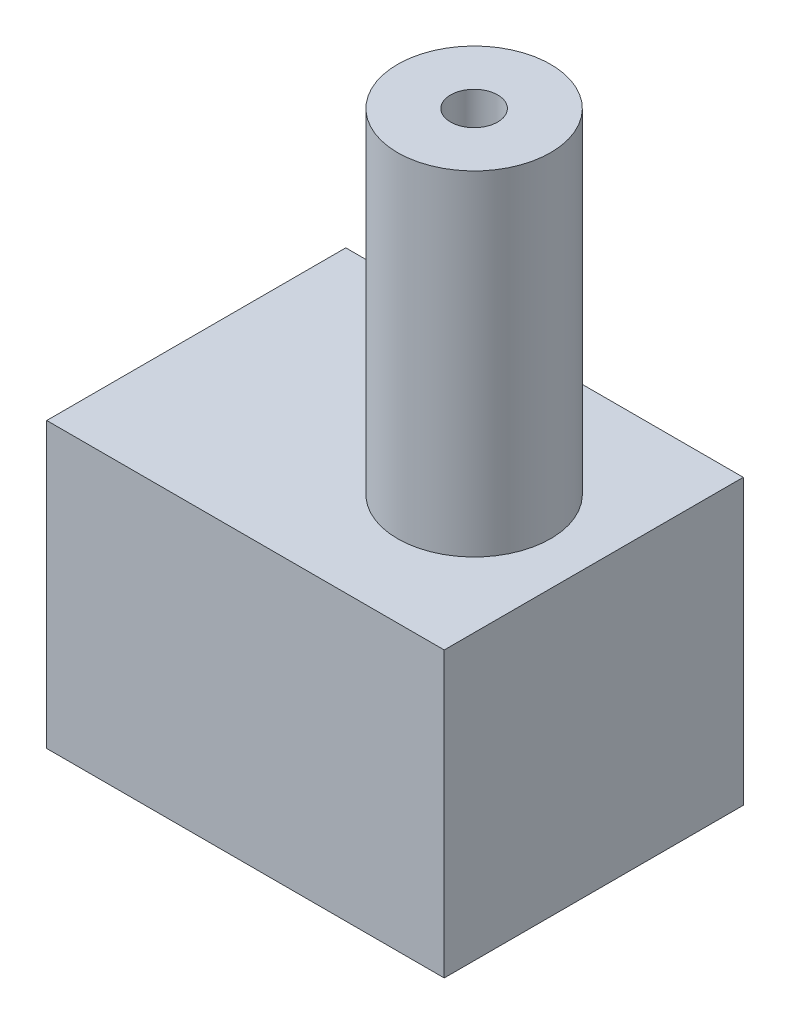
ISO-10303-21;
HEADER;
FILE_DESCRIPTION(('STEP AP214'),'2;1');
FILE_NAME('part.step','',(''),(''),'','','');
FILE_SCHEMA(('AUTOMOTIVE_DESIGN { 1 0 10303 214 1 1 1 1 }'));
ENDSEC;
DATA;
#1=APPLICATION_CONTEXT('core data for automotive mechanical design processes');
#2=APPLICATION_PROTOCOL_DEFINITION('international standard','automotive_design',2000,#1);
#3=PRODUCT_CONTEXT('',#1,'mechanical');
#4=PRODUCT('Part','Part','',(#3));
#5=PRODUCT_RELATED_PRODUCT_CATEGORY('part','',(#4));
#6=PRODUCT_DEFINITION_FORMATION('','',#4);
#7=PRODUCT_DEFINITION_CONTEXT('part definition',#1,'design');
#8=PRODUCT_DEFINITION('design','',#6,#7);
#9=PRODUCT_DEFINITION_SHAPE('','',#8);
#10=(LENGTH_UNIT() NAMED_UNIT(*) SI_UNIT(.MILLI.,.METRE.));
#11=(NAMED_UNIT(*) PLANE_ANGLE_UNIT() SI_UNIT($,.RADIAN.));
#12=(NAMED_UNIT(*) SI_UNIT($,.STERADIAN.) SOLID_ANGLE_UNIT());
#13=UNCERTAINTY_MEASURE_WITH_UNIT(LENGTH_MEASURE(1.E-05),#10,'distance_accuracy_value','');
#14=(GEOMETRIC_REPRESENTATION_CONTEXT(3) GLOBAL_UNCERTAINTY_ASSIGNED_CONTEXT((#13)) GLOBAL_UNIT_ASSIGNED_CONTEXT((#10,
#11,#12)) REPRESENTATION_CONTEXT('',''));
#15=CARTESIAN_POINT('',(0.,0.,0.));
#16=DIRECTION('',(0.,0.,1.));
#17=DIRECTION('',(1.,0.,0.));
#18=AXIS2_PLACEMENT_3D('',#15,#16,#17);
#19=CARTESIAN_POINT('',(0.,12.065,0.));
#20=DIRECTION('',(0.,1.,0.));
#21=DIRECTION('',(0.,0.,1.));
#22=AXIS2_PLACEMENT_3D('',#19,#20,#21);
#23=PLANE('',#22);
#24=DIRECTION('',(1.,0.,0.));
#25=VECTOR('',#24,1.);
#26=CARTESIAN_POINT('',(0.,12.065,0.));
#27=LINE('',#26,#25);
#28=CARTESIAN_POINT('',(0.,12.065,0.));
#29=VERTEX_POINT('',#28);
#30=CARTESIAN_POINT('',(16.88,12.065,0.));
#31=VERTEX_POINT('',#30);
#32=EDGE_CURVE('E84',#29,#31,#27,.T.);
#33=ORIENTED_EDGE('',*,*,#32,.T.);
#34=DIRECTION('',(0.,0.,-1.));
#35=VECTOR('',#34,1.);
#36=CARTESIAN_POINT('',(16.88,12.065,0.));
#37=LINE('',#36,#35);
#38=CARTESIAN_POINT('',(16.88,12.065,-12.7));
#39=VERTEX_POINT('',#38);
#40=EDGE_CURVE('E79',#31,#39,#37,.T.);
#41=ORIENTED_EDGE('',*,*,#40,.T.);
#42=DIRECTION('',(-1.,0.,0.));
#43=VECTOR('',#42,1.);
#44=CARTESIAN_POINT('',(0.,12.065,-12.7));
#45=LINE('',#44,#43);
#46=CARTESIAN_POINT('',(0.,12.065,-12.7));
#47=VERTEX_POINT('',#46);
#48=EDGE_CURVE('E82',#39,#47,#45,.T.);
#49=ORIENTED_EDGE('',*,*,#48,.T.);
#50=DIRECTION('',(0.,0.,1.));
#51=VECTOR('',#50,1.);
#52=CARTESIAN_POINT('',(0.,12.065,0.));
#53=LINE('',#52,#51);
#54=EDGE_CURVE('E49',#47,#29,#53,.T.);
#55=ORIENTED_EDGE('',*,*,#54,.T.);
#56=EDGE_LOOP('',(#33,#41,#49,#55));
#57=FACE_BOUND('',#56,.T.);
#58=CARTESIAN_POINT('',(11.8,12.065,-6.35));
#59=DIRECTION('',(0.,1.,0.));
#60=DIRECTION('',(0.,0.,1.));
#61=AXIS2_PLACEMENT_3D('',#58,#59,#60);
#62=CIRCLE('',#61,3.25);
#63=CARTESIAN_POINT('',(11.8,12.065,-3.1));
#64=VERTEX_POINT('',#63);
#65=EDGE_CURVE('E110',#64,#64,#62,.T.);
#66=ORIENTED_EDGE('',*,*,#65,.F.);
#67=EDGE_LOOP('',(#66));
#68=FACE_BOUND('',#67,.T.);
#69=ADVANCED_FACE('F32',(#57,#68),#23,.T.);
#70=CARTESIAN_POINT('',(0.,12.065,0.));
#71=DIRECTION('',(0.,0.,-1.));
#72=DIRECTION('',(-1.,0.,0.));
#73=AXIS2_PLACEMENT_3D('',#70,#71,#72);
#74=PLANE('',#73);
#75=DIRECTION('',(1.,0.,0.));
#76=VECTOR('',#75,1.);
#77=CARTESIAN_POINT('',(0.,0.,0.));
#78=LINE('',#77,#76);
#79=CARTESIAN_POINT('',(0.,0.,0.));
#80=VERTEX_POINT('',#79);
#81=CARTESIAN_POINT('',(16.88,0.,0.));
#82=VERTEX_POINT('',#81);
#83=EDGE_CURVE('E96',#80,#82,#78,.T.);
#84=ORIENTED_EDGE('',*,*,#83,.T.);
#85=DIRECTION('',(0.,-1.,0.));
#86=VECTOR('',#85,1.);
#87=CARTESIAN_POINT('',(16.88,12.065,0.));
#88=LINE('',#87,#86);
#89=EDGE_CURVE('E11',#31,#82,#88,.T.);
#90=ORIENTED_EDGE('',*,*,#89,.F.);
#91=ORIENTED_EDGE('',*,*,#32,.F.);
#92=DIRECTION('',(0.,-1.,0.));
#93=VECTOR('',#92,1.);
#94=CARTESIAN_POINT('',(0.,12.065,0.));
#95=LINE('',#94,#93);
#96=EDGE_CURVE('E92',#29,#80,#95,.T.);
#97=ORIENTED_EDGE('',*,*,#96,.T.);
#98=EDGE_LOOP('',(#84,#90,#91,#97));
#99=FACE_BOUND('',#98,.T.);
#100=ADVANCED_FACE('F34',(#99),#74,.F.);
#101=CARTESIAN_POINT('',(16.88,12.065,0.));
#102=DIRECTION('',(-1.,0.,0.));
#103=DIRECTION('',(0.,0.,1.));
#104=AXIS2_PLACEMENT_3D('',#101,#102,#103);
#105=PLANE('',#104);
#106=DIRECTION('',(0.,0.,-1.));
#107=VECTOR('',#106,1.);
#108=CARTESIAN_POINT('',(16.88,0.,0.));
#109=LINE('',#108,#107);
#110=CARTESIAN_POINT('',(16.88,0.,-12.7));
#111=VERTEX_POINT('',#110);
#112=EDGE_CURVE('E88',#82,#111,#109,.T.);
#113=ORIENTED_EDGE('',*,*,#112,.T.);
#114=DIRECTION('',(0.,-1.,0.));
#115=VECTOR('',#114,1.);
#116=CARTESIAN_POINT('',(16.88,12.065,-12.7));
#117=LINE('',#116,#115);
#118=EDGE_CURVE('E41',#39,#111,#117,.T.);
#119=ORIENTED_EDGE('',*,*,#118,.F.);
#120=ORIENTED_EDGE('',*,*,#40,.F.);
#121=ORIENTED_EDGE('',*,*,#89,.T.);
#122=EDGE_LOOP('',(#113,#119,#120,#121));
#123=FACE_BOUND('',#122,.T.);
#124=ADVANCED_FACE('F87',(#123),#105,.F.);
#125=CARTESIAN_POINT('',(0.,12.065,-12.7));
#126=DIRECTION('',(0.,0.,1.));
#127=DIRECTION('',(1.,0.,0.));
#128=AXIS2_PLACEMENT_3D('',#125,#126,#127);
#129=PLANE('',#128);
#130=DIRECTION('',(-1.,0.,0.));
#131=VECTOR('',#130,1.);
#132=CARTESIAN_POINT('',(0.,0.,-12.7));
#133=LINE('',#132,#131);
#134=CARTESIAN_POINT('',(0.,0.,-12.7));
#135=VERTEX_POINT('',#134);
#136=EDGE_CURVE('E66',#111,#135,#133,.T.);
#137=ORIENTED_EDGE('',*,*,#136,.T.);
#138=DIRECTION('',(0.,-1.,0.));
#139=VECTOR('',#138,1.);
#140=CARTESIAN_POINT('',(0.,12.065,-12.7));
#141=LINE('',#140,#139);
#142=EDGE_CURVE('E89',#47,#135,#141,.T.);
#143=ORIENTED_EDGE('',*,*,#142,.F.);
#144=ORIENTED_EDGE('',*,*,#48,.F.);
#145=ORIENTED_EDGE('',*,*,#118,.T.);
#146=EDGE_LOOP('',(#137,#143,#144,#145));
#147=FACE_BOUND('',#146,.T.);
#148=ADVANCED_FACE('F90',(#147),#129,.F.);
#149=CARTESIAN_POINT('',(0.,12.065,0.));
#150=DIRECTION('',(1.,0.,0.));
#151=DIRECTION('',(0.,0.,-1.));
#152=AXIS2_PLACEMENT_3D('',#149,#150,#151);
#153=PLANE('',#152);
#154=DIRECTION('',(0.,0.,1.));
#155=VECTOR('',#154,1.);
#156=CARTESIAN_POINT('',(0.,0.,0.));
#157=LINE('',#156,#155);
#158=EDGE_CURVE('E72',#135,#80,#157,.T.);
#159=ORIENTED_EDGE('',*,*,#158,.T.);
#160=ORIENTED_EDGE('',*,*,#96,.F.);
#161=ORIENTED_EDGE('',*,*,#54,.F.);
#162=ORIENTED_EDGE('',*,*,#142,.T.);
#163=EDGE_LOOP('',(#159,#160,#161,#162));
#164=FACE_BOUND('',#163,.T.);
#165=ADVANCED_FACE('F104',(#164),#153,.F.);
#166=CARTESIAN_POINT('',(0.,0.,0.));
#167=DIRECTION('',(0.,1.,0.));
#168=DIRECTION('',(0.,0.,1.));
#169=AXIS2_PLACEMENT_3D('',#166,#167,#168);
#170=PLANE('',#169);
#171=CARTESIAN_POINT('',(11.8,0.,-6.35));
#172=DIRECTION('',(0.,1.,0.));
#173=DIRECTION('',(0.,0.,1.));
#174=AXIS2_PLACEMENT_3D('',#171,#172,#173);
#175=CIRCLE('',#174,1.);
#176=CARTESIAN_POINT('',(11.8,0.,-5.35));
#177=VERTEX_POINT('',#176);
#178=EDGE_CURVE('E113',#177,#177,#175,.T.);
#179=ORIENTED_EDGE('',*,*,#178,.T.);
#180=EDGE_LOOP('',(#179));
#181=FACE_BOUND('',#180,.T.);
#182=ORIENTED_EDGE('',*,*,#83,.F.);
#183=ORIENTED_EDGE('',*,*,#158,.F.);
#184=ORIENTED_EDGE('',*,*,#136,.F.);
#185=ORIENTED_EDGE('',*,*,#112,.F.);
#186=EDGE_LOOP('',(#182,#183,#184,#185));
#187=FACE_BOUND('',#186,.T.);
#188=ADVANCED_FACE('F107',(#181,#187),#170,.F.);
#189=CARTESIAN_POINT('',(11.8,26.265,-6.35));
#190=DIRECTION('',(0.,-1.,0.));
#191=DIRECTION('',(0.,0.,-1.));
#192=AXIS2_PLACEMENT_3D('',#189,#190,#191);
#193=CYLINDRICAL_SURFACE('',#192,3.25);
#194=CARTESIAN_POINT('',(11.8,26.265,-6.35));
#195=DIRECTION('',(0.,1.,0.));
#196=DIRECTION('',(0.,0.,1.));
#197=AXIS2_PLACEMENT_3D('',#194,#195,#196);
#198=CIRCLE('',#197,3.25);
#199=CARTESIAN_POINT('',(11.8,26.265,-3.1));
#200=VERTEX_POINT('',#199);
#201=EDGE_CURVE('E99',#200,#200,#198,.T.);
#202=ORIENTED_EDGE('',*,*,#201,.F.);
#203=EDGE_LOOP('',(#202));
#204=FACE_BOUND('',#203,.T.);
#205=ORIENTED_EDGE('',*,*,#65,.T.);
#206=EDGE_LOOP('',(#205));
#207=FACE_BOUND('',#206,.T.);
#208=ADVANCED_FACE('F132',(#204,#207),#193,.T.);
#209=CARTESIAN_POINT('',(11.8,26.265,-6.35));
#210=DIRECTION('',(0.,1.,0.));
#211=DIRECTION('',(0.,0.,1.));
#212=AXIS2_PLACEMENT_3D('',#209,#210,#211);
#213=PLANE('',#212);
#214=CARTESIAN_POINT('',(11.8,26.265,-6.35));
#215=DIRECTION('',(0.,1.,0.));
#216=DIRECTION('',(0.,0.,1.));
#217=AXIS2_PLACEMENT_3D('',#214,#215,#216);
#218=CIRCLE('',#217,1.);
#219=CARTESIAN_POINT('',(11.8,26.265,-5.35));
#220=VERTEX_POINT('',#219);
#221=EDGE_CURVE('E116',#220,#220,#218,.T.);
#222=ORIENTED_EDGE('',*,*,#221,.F.);
#223=EDGE_LOOP('',(#222));
#224=FACE_BOUND('',#223,.T.);
#225=ORIENTED_EDGE('',*,*,#201,.T.);
#226=EDGE_LOOP('',(#225));
#227=FACE_BOUND('',#226,.T.);
#228=ADVANCED_FACE('F126',(#224,#227),#213,.T.);
#229=CARTESIAN_POINT('',(11.8,0.,-6.35));
#230=DIRECTION('',(0.,1.,0.));
#231=DIRECTION('',(0.,0.,1.));
#232=AXIS2_PLACEMENT_3D('',#229,#230,#231);
#233=CYLINDRICAL_SURFACE('',#232,1.);
#234=ORIENTED_EDGE('',*,*,#178,.F.);
#235=EDGE_LOOP('',(#234));
#236=FACE_BOUND('',#235,.T.);
#237=ORIENTED_EDGE('',*,*,#221,.T.);
#238=EDGE_LOOP('',(#237));
#239=FACE_BOUND('',#238,.T.);
#240=ADVANCED_FACE('F123',(#236,#239),#233,.F.);
#241=CLOSED_SHELL('',(#69,#100,#124,#148,#165,#188,#208,#228,#240));
#242=MANIFOLD_SOLID_BREP('B2',#241);
#243=ADVANCED_BREP_SHAPE_REPRESENTATION('',(#18,#242),#14);
#244=SHAPE_DEFINITION_REPRESENTATION(#9,#243);
ENDSEC;
END-ISO-10303-21;
